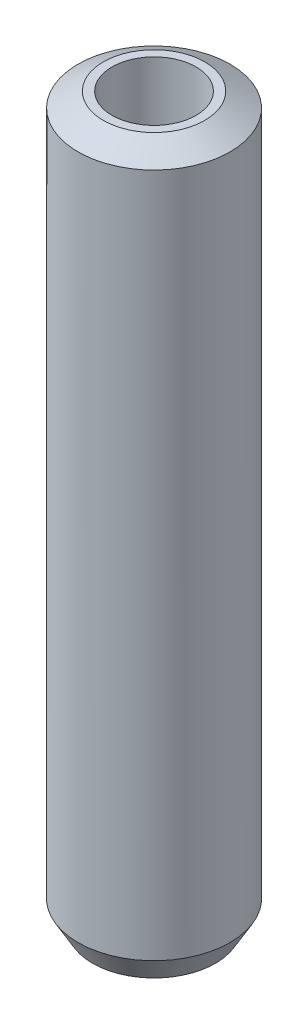
ISO-10303-21;
HEADER;
FILE_DESCRIPTION(('STEP AP214'),'2;1');
FILE_NAME('part.step','',(''),(''),'','','');
FILE_SCHEMA(('AUTOMOTIVE_DESIGN { 1 0 10303 214 1 1 1 1 }'));
ENDSEC;
DATA;
#1=APPLICATION_CONTEXT('core data for automotive mechanical design processes');
#2=APPLICATION_PROTOCOL_DEFINITION('international standard','automotive_design',2000,#1);
#3=PRODUCT_CONTEXT('',#1,'mechanical');
#4=PRODUCT('Part','Part','',(#3));
#5=PRODUCT_RELATED_PRODUCT_CATEGORY('part','',(#4));
#6=PRODUCT_DEFINITION_FORMATION('','',#4);
#7=PRODUCT_DEFINITION_CONTEXT('part definition',#1,'design');
#8=PRODUCT_DEFINITION('design','',#6,#7);
#9=PRODUCT_DEFINITION_SHAPE('','',#8);
#10=(LENGTH_UNIT() NAMED_UNIT(*) SI_UNIT(.MILLI.,.METRE.));
#11=(NAMED_UNIT(*) PLANE_ANGLE_UNIT() SI_UNIT($,.RADIAN.));
#12=(NAMED_UNIT(*) SI_UNIT($,.STERADIAN.) SOLID_ANGLE_UNIT());
#13=UNCERTAINTY_MEASURE_WITH_UNIT(LENGTH_MEASURE(1.E-05),#10,'distance_accuracy_value','');
#14=(GEOMETRIC_REPRESENTATION_CONTEXT(3) GLOBAL_UNCERTAINTY_ASSIGNED_CONTEXT((#13)) GLOBAL_UNIT_ASSIGNED_CONTEXT((#10,
#11,#12)) REPRESENTATION_CONTEXT('',''));
#15=CARTESIAN_POINT('',(0.,0.,0.));
#16=DIRECTION('',(0.,0.,1.));
#17=DIRECTION('',(1.,0.,0.));
#18=AXIS2_PLACEMENT_3D('',#15,#16,#17);
#19=CARTESIAN_POINT('',(0.,119.13742233596,0.));
#20=DIRECTION('',(0.,-1.,0.));
#21=DIRECTION('',(0.,0.,-1.));
#22=AXIS2_PLACEMENT_3D('',#19,#20,#21);
#23=CYLINDRICAL_SURFACE('',#22,12.5);
#24=CARTESIAN_POINT('',(0.,116.73542343699,0.));
#25=DIRECTION('',(0.,1.,0.));
#26=DIRECTION('',(0.,0.,1.));
#27=AXIS2_PLACEMENT_3D('',#24,#25,#26);
#28=CIRCLE('',#27,12.5);
#29=CARTESIAN_POINT('',(0.,116.73542343699,-12.5));
#30=VERTEX_POINT('',#29);
#31=EDGE_CURVE('E50',#30,#30,#28,.F.);
#32=ORIENTED_EDGE('',*,*,#31,.T.);
#33=EDGE_LOOP('',(#32));
#34=FACE_BOUND('',#33,.T.);
#35=CARTESIAN_POINT('',(0.,4.16038413274109,0.));
#36=DIRECTION('',(0.,1.,0.));
#37=DIRECTION('',(0.,0.,1.));
#38=AXIS2_PLACEMENT_3D('',#35,#36,#37);
#39=CIRCLE('',#38,12.5);
#40=CARTESIAN_POINT('',(0.,4.16038413274109,12.5));
#41=VERTEX_POINT('',#40);
#42=EDGE_CURVE('E51',#41,#41,#39,.T.);
#43=ORIENTED_EDGE('',*,*,#42,.T.);
#44=EDGE_LOOP('',(#43));
#45=FACE_BOUND('',#44,.T.);
#46=ADVANCED_FACE('F39',(#34,#45),#23,.T.);
#47=CARTESIAN_POINT('',(0.,119.13742233596,0.));
#48=DIRECTION('',(0.,1.,0.));
#49=DIRECTION('',(0.,0.,1.));
#50=AXIS2_PLACEMENT_3D('',#47,#48,#49);
#51=PLANE('',#50);
#52=CARTESIAN_POINT('',(0.,119.13742233596,0.));
#53=DIRECTION('',(0.,1.,0.));
#54=DIRECTION('',(0.,0.,1.));
#55=AXIS2_PLACEMENT_3D('',#52,#53,#54);
#56=CIRCLE('',#55,8.33961586725897);
#57=CARTESIAN_POINT('',(0.,119.13742233596,-8.33961586725898));
#58=VERTEX_POINT('',#57);
#59=EDGE_CURVE('E54',#58,#58,#56,.T.);
#60=ORIENTED_EDGE('',*,*,#59,.T.);
#61=EDGE_LOOP('',(#60));
#62=FACE_BOUND('',#61,.T.);
#63=CARTESIAN_POINT('',(0.,119.13742233596,0.));
#64=DIRECTION('',(0.,1.,0.));
#65=DIRECTION('',(0.,0.,1.));
#66=AXIS2_PLACEMENT_3D('',#63,#64,#65);
#67=CIRCLE('',#66,6.90839890642279);
#68=CARTESIAN_POINT('',(0.,119.13742233596,6.90839890642279));
#69=VERTEX_POINT('',#68);
#70=EDGE_CURVE('E58',#69,#69,#67,.T.);
#71=ORIENTED_EDGE('',*,*,#70,.F.);
#72=EDGE_LOOP('',(#71));
#73=FACE_BOUND('',#72,.T.);
#74=ADVANCED_FACE('F69',(#62,#73),#51,.T.);
#75=CARTESIAN_POINT('',(0.,0.,0.));
#76=DIRECTION('',(0.,1.,0.));
#77=DIRECTION('',(0.,0.,1.));
#78=AXIS2_PLACEMENT_3D('',#75,#76,#77);
#79=PLANE('',#78);
#80=CARTESIAN_POINT('',(0.,0.,0.));
#81=DIRECTION('',(0.,1.,0.));
#82=DIRECTION('',(0.,0.,1.));
#83=AXIS2_PLACEMENT_3D('',#80,#81,#82);
#84=CIRCLE('',#83,10.0980011010297);
#85=CARTESIAN_POINT('',(0.,0.,10.0980011010297));
#86=VERTEX_POINT('',#85);
#87=EDGE_CURVE('E10',#86,#86,#84,.F.);
#88=ORIENTED_EDGE('',*,*,#87,.T.);
#89=EDGE_LOOP('',(#88));
#90=FACE_BOUND('',#89,.T.);
#91=CARTESIAN_POINT('',(0.,0.,0.));
#92=DIRECTION('',(0.,1.,0.));
#93=DIRECTION('',(0.,0.,1.));
#94=AXIS2_PLACEMENT_3D('',#91,#92,#93);
#95=CIRCLE('',#94,6.90839890642279);
#96=CARTESIAN_POINT('',(0.,0.,6.90839890642279));
#97=VERTEX_POINT('',#96);
#98=EDGE_CURVE('E63',#97,#97,#95,.T.);
#99=ORIENTED_EDGE('',*,*,#98,.T.);
#100=EDGE_LOOP('',(#99));
#101=FACE_BOUND('',#100,.T.);
#102=ADVANCED_FACE('F75',(#90,#101),#79,.F.);
#103=CARTESIAN_POINT('',(0.,119.13742233596,0.));
#104=DIRECTION('',(0.,-1.,0.));
#105=DIRECTION('',(0.,0.,-1.));
#106=AXIS2_PLACEMENT_3D('',#103,#104,#105);
#107=CYLINDRICAL_SURFACE('',#106,6.90839890642279);
#108=ORIENTED_EDGE('',*,*,#70,.T.);
#109=EDGE_LOOP('',(#108));
#110=FACE_BOUND('',#109,.T.);
#111=ORIENTED_EDGE('',*,*,#98,.F.);
#112=EDGE_LOOP('',(#111));
#113=FACE_BOUND('',#112,.T.);
#114=ADVANCED_FACE('F70',(#110,#113),#107,.F.);
#115=CARTESIAN_POINT('',(0.,119.13742233596,0.));
#116=DIRECTION('',(0.,-1.,0.));
#117=DIRECTION('',(0.,0.,-1.));
#118=AXIS2_PLACEMENT_3D('',#115,#116,#117);
#119=CONICAL_SURFACE('',#118,8.33961586725897,1.04719755119659);
#120=CARTESIAN_POINT('',(0.,116.73542343699,-12.5));
#121=CARTESIAN_POINT('',(0.,116.760444258854,-12.456662665284));
#122=CARTESIAN_POINT('',(0.,116.785465080718,-12.4133253305679));
#123=CARTESIAN_POINT('',(0.,116.835506724447,-12.3266506611358));
#124=CARTESIAN_POINT('',(0.,116.860527546311,-12.2833133264198));
#125=CARTESIAN_POINT('',(0.,116.91056919004,-12.1966386569876));
#126=CARTESIAN_POINT('',(0.,116.935590011904,-12.1533013222716));
#127=CARTESIAN_POINT('',(0.,116.985631655632,-12.0666266528395));
#128=CARTESIAN_POINT('',(0.,117.010652477497,-12.0232893181234));
#129=CARTESIAN_POINT('',(0.,117.060694121225,-11.9366146486913));
#130=CARTESIAN_POINT('',(0.,117.08571494309,-11.8932773139753));
#131=CARTESIAN_POINT('',(0.,117.135756586818,-11.8066026445432));
#132=CARTESIAN_POINT('',(0.,117.160777408682,-11.7632653098271));
#133=CARTESIAN_POINT('',(0.,117.210819052411,-11.676590640395));
#134=CARTESIAN_POINT('',(0.,117.235839874275,-11.633253305679));
#135=CARTESIAN_POINT('',(0.,117.285881518004,-11.5465786362469));
#136=CARTESIAN_POINT('',(0.,117.310902339868,-11.5032413015308));
#137=CARTESIAN_POINT('',(0.,117.360943983597,-11.4165666320987));
#138=CARTESIAN_POINT('',(0.,117.385964805461,-11.3732292973827));
#139=CARTESIAN_POINT('',(0.,117.436006449189,-11.2865546279505));
#140=CARTESIAN_POINT('',(0.,117.461027271054,-11.2432172932345));
#141=CARTESIAN_POINT('',(0.,117.511068914782,-11.1565426238024));
#142=CARTESIAN_POINT('',(0.,117.536089736647,-11.1132052890863));
#143=CARTESIAN_POINT('',(0.,117.586131380375,-11.0265306196542));
#144=CARTESIAN_POINT('',(0.,117.611152202239,-10.9831932849382));
#145=CARTESIAN_POINT('',(0.,117.661193845968,-10.8965186155061));
#146=CARTESIAN_POINT('',(0.,117.686214667832,-10.85318128079));
#147=CARTESIAN_POINT('',(0.,117.736256311561,-10.7665066113579));
#148=CARTESIAN_POINT('',(0.,117.761277133425,-10.7231692766419));
#149=CARTESIAN_POINT('',(0.,117.811318777154,-10.6364946072098));
#150=CARTESIAN_POINT('',(0.,117.836339599018,-10.5931572724937));
#151=CARTESIAN_POINT('',(0.,117.886381242746,-10.5064826030616));
#152=CARTESIAN_POINT('',(0.,117.911402064611,-10.4631452683455));
#153=CARTESIAN_POINT('',(0.,117.961443708339,-10.3764705989134));
#154=CARTESIAN_POINT('',(0.,117.986464530203,-10.3331332641974));
#155=CARTESIAN_POINT('',(0.,118.036506173932,-10.2464585947653));
#156=CARTESIAN_POINT('',(0.,118.061526995796,-10.2031212600492));
#157=CARTESIAN_POINT('',(0.,118.111568639525,-10.1164465906171));
#158=CARTESIAN_POINT('',(0.,118.136589461389,-10.0731092559011));
#159=CARTESIAN_POINT('',(0.,118.186631105118,-9.98643458646897));
#160=CARTESIAN_POINT('',(0.,118.211651926982,-9.94309725175292));
#161=CARTESIAN_POINT('',(0.,118.26169357071,-9.85642258232082));
#162=CARTESIAN_POINT('',(0.,118.286714392575,-9.81308524760476));
#163=CARTESIAN_POINT('',(0.,118.336756036303,-9.72641057817266));
#164=CARTESIAN_POINT('',(0.,118.361776858168,-9.6830732434566));
#165=CARTESIAN_POINT('',(0.,118.411818501896,-9.5963985740245));
#166=CARTESIAN_POINT('',(0.,118.43683932376,-9.55306123930845));
#167=CARTESIAN_POINT('',(0.,118.486880967489,-9.46638656987634));
#168=CARTESIAN_POINT('',(0.,118.511901789353,-9.42304923516029));
#169=CARTESIAN_POINT('',(0.,118.561943433082,-9.33637456572819));
#170=CARTESIAN_POINT('',(0.,118.586964254946,-9.29303723101213));
#171=CARTESIAN_POINT('',(0.,118.637005898675,-9.20636256158003));
#172=CARTESIAN_POINT('',(0.,118.662026720539,-9.16302522686398));
#173=CARTESIAN_POINT('',(0.,118.712068364267,-9.07635055743187));
#174=CARTESIAN_POINT('',(0.,118.737089186132,-9.03301322271582));
#175=CARTESIAN_POINT('',(0.,118.78713082986,-8.94633855328371));
#176=CARTESIAN_POINT('',(0.,118.812151651725,-8.90300121856766));
#177=CARTESIAN_POINT('',(0.,118.862193295453,-8.81632654913556));
#178=CARTESIAN_POINT('',(0.,118.887214117317,-8.7729892144195));
#179=CARTESIAN_POINT('',(0.,118.937255761046,-8.6863145449874));
#180=CARTESIAN_POINT('',(0.,118.96227658291,-8.64297721027135));
#181=CARTESIAN_POINT('',(0.,119.012318226639,-8.55630254083924));
#182=CARTESIAN_POINT('',(0.,119.037339048503,-8.51296520612319));
#183=CARTESIAN_POINT('',(0.,119.087380692232,-8.42629053669108));
#184=CARTESIAN_POINT('',(0.,119.112401514096,-8.38295320197503));
#185=CARTESIAN_POINT('',(0.,119.13742233596,-8.33961586725898));
#186=B_SPLINE_CURVE_WITH_KNOTS('',3,(#120,#121,#122,#123,#124,#125,#126,#127,#128,#129,#130,
#131,#132,#133,#134,#135,#136,#137,#138,#139,#140,#141,#142,#143,#144,#145,#146,#147,#148,#149,
#150,#151,#152,#153,#154,#155,#156,#157,#158,#159,#160,#161,#162,#163,#164,#165,#166,#167,#168,
#169,#170,#171,#172,#173,#174,#175,#176,#177,#178,#179,#180,#181,#182,#183,#184,#185),
.UNSPECIFIED.,.F.,.F.,(4,2,2,2,2,2,2,2,2,2,2,2,2,2,2,2,2,2,2,2,2,2,2,2,2,2,2,2,2,2,2,2,4),(0.,
0.150124931185646,0.300249862371286,0.450374793556933,0.600499724742572,0.750624655928219,
0.900749587113859,1.0508745182995,1.20099944948515,1.35112438067079,1.50124931185643,
1.65137424304208,1.80149917422772,1.95162410541336,2.101749036599,2.25187396778465,
2.40199889897029,2.55212383015594,2.70224876134158,2.85237369252722,3.00249862371286,
3.15262355489851,3.30274848608415,3.45287341726979,3.60299834845543,3.75312327964108,
3.90324821082672,4.05337314201237,4.20349807319801,4.35362300438365,4.5037479355693,
4.65387286675494,4.80399779794059),.UNSPECIFIED.);
#187=EDGE_CURVE('BSEAM81',#30,#58,#186,.T.);
#188=ORIENTED_EDGE('',*,*,#31,.F.);
#189=ORIENTED_EDGE('',*,*,#59,.F.);
#190=ORIENTED_EDGE('',*,*,#187,.T.);
#191=ORIENTED_EDGE('',*,*,#187,.F.);
#192=EDGE_LOOP('',(#188,#190,#189,#191));
#193=FACE_BOUND('',#192,.T.);
#194=ADVANCED_FACE('F81',(#193),#119,.T.);
#195=CARTESIAN_POINT('',(0.,4.16038413274109,0.));
#196=DIRECTION('',(0.,1.,0.));
#197=DIRECTION('',(0.,0.,1.));
#198=AXIS2_PLACEMENT_3D('',#195,#196,#197);
#199=CONICAL_SURFACE('',#198,12.5,0.523598775598301);
#200=ORIENTED_EDGE('',*,*,#87,.F.);
#201=EDGE_LOOP('',(#200));
#202=FACE_BOUND('',#201,.T.);
#203=ORIENTED_EDGE('',*,*,#42,.F.);
#204=EDGE_LOOP('',(#203));
#205=FACE_BOUND('',#204,.T.);
#206=ADVANCED_FACE('F45',(#202,#205),#199,.T.);
#207=CLOSED_SHELL('',(#46,#74,#102,#114,#194,#206));
#208=MANIFOLD_SOLID_BREP('B2',#207);
#209=ADVANCED_BREP_SHAPE_REPRESENTATION('',(#18,#208),#14);
#210=SHAPE_DEFINITION_REPRESENTATION(#9,#209);
ENDSEC;
END-ISO-10303-21;
